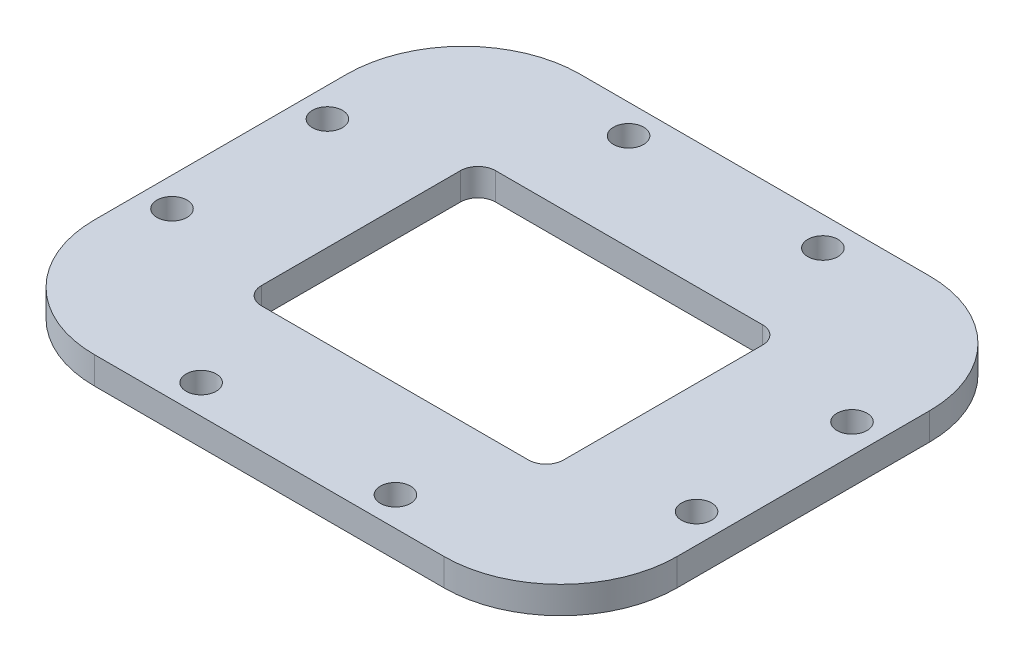
ISO-10303-21;
HEADER;
FILE_DESCRIPTION(('STEP AP214'),'2;1');
FILE_NAME('part.step','',(''),(''),'','','');
FILE_SCHEMA(('AUTOMOTIVE_DESIGN { 1 0 10303 214 1 1 1 1 }'));
ENDSEC;
DATA;
#1=APPLICATION_CONTEXT('core data for automotive mechanical design processes');
#2=APPLICATION_PROTOCOL_DEFINITION('international standard','automotive_design',2000,#1);
#3=PRODUCT_CONTEXT('',#1,'mechanical');
#4=PRODUCT('Part','Part','',(#3));
#5=PRODUCT_RELATED_PRODUCT_CATEGORY('part','',(#4));
#6=PRODUCT_DEFINITION_FORMATION('','',#4);
#7=PRODUCT_DEFINITION_CONTEXT('part definition',#1,'design');
#8=PRODUCT_DEFINITION('design','',#6,#7);
#9=PRODUCT_DEFINITION_SHAPE('','',#8);
#10=(LENGTH_UNIT() NAMED_UNIT(*) SI_UNIT(.MILLI.,.METRE.));
#11=(NAMED_UNIT(*) PLANE_ANGLE_UNIT() SI_UNIT($,.RADIAN.));
#12=(NAMED_UNIT(*) SI_UNIT($,.STERADIAN.) SOLID_ANGLE_UNIT());
#13=UNCERTAINTY_MEASURE_WITH_UNIT(LENGTH_MEASURE(1.E-05),#10,'distance_accuracy_value','');
#14=(GEOMETRIC_REPRESENTATION_CONTEXT(3) GLOBAL_UNCERTAINTY_ASSIGNED_CONTEXT((#13)) GLOBAL_UNIT_ASSIGNED_CONTEXT((#10,
#11,#12)) REPRESENTATION_CONTEXT('',''));
#15=CARTESIAN_POINT('',(0.,0.,0.));
#16=DIRECTION('',(0.,0.,1.));
#17=DIRECTION('',(1.,0.,0.));
#18=AXIS2_PLACEMENT_3D('',#15,#16,#17);
#19=CARTESIAN_POINT('',(0.,2.8,0.));
#20=DIRECTION('',(0.,1.,0.));
#21=DIRECTION('',(0.,0.,1.));
#22=AXIS2_PLACEMENT_3D('',#19,#20,#21);
#23=PLANE('',#22);
#24=CARTESIAN_POINT('',(13.75,2.8,10.25));
#25=DIRECTION('',(0.,1.,0.));
#26=DIRECTION('',(0.,0.,1.));
#27=AXIS2_PLACEMENT_3D('',#24,#25,#26);
#28=CIRCLE('',#27,1.8);
#29=CARTESIAN_POINT('',(13.75,2.8,12.05));
#30=VERTEX_POINT('',#29);
#31=CARTESIAN_POINT('',(15.55,2.8,10.25));
#32=VERTEX_POINT('',#31);
#33=EDGE_CURVE('E211',#30,#32,#28,.T.);
#34=ORIENTED_EDGE('',*,*,#33,.F.);
#35=DIRECTION('',(1.,0.,0.));
#36=VECTOR('',#35,1.);
#37=CARTESIAN_POINT('',(0.,2.8,12.05));
#38=LINE('',#37,#36);
#39=CARTESIAN_POINT('',(-13.75,2.8,12.05));
#40=VERTEX_POINT('',#39);
#41=EDGE_CURVE('E188',#40,#30,#38,.T.);
#42=ORIENTED_EDGE('',*,*,#41,.F.);
#43=CARTESIAN_POINT('',(-13.75,2.8,10.25));
#44=DIRECTION('',(0.,1.,0.));
#45=DIRECTION('',(0.,0.,1.));
#46=AXIS2_PLACEMENT_3D('',#43,#44,#45);
#47=CIRCLE('',#46,1.8);
#48=CARTESIAN_POINT('',(-15.55,2.8,10.25));
#49=VERTEX_POINT('',#48);
#50=EDGE_CURVE('E155',#49,#40,#47,.T.);
#51=ORIENTED_EDGE('',*,*,#50,.F.);
#52=DIRECTION('',(0.,0.,1.));
#53=VECTOR('',#52,1.);
#54=CARTESIAN_POINT('',(-15.55,2.8,0.));
#55=LINE('',#54,#53);
#56=CARTESIAN_POINT('',(-15.55,2.8,-10.25));
#57=VERTEX_POINT('',#56);
#58=EDGE_CURVE('E201',#57,#49,#55,.T.);
#59=ORIENTED_EDGE('',*,*,#58,.F.);
#60=CARTESIAN_POINT('',(-13.75,2.8,-10.25));
#61=DIRECTION('',(0.,1.,0.));
#62=DIRECTION('',(0.,0.,1.));
#63=AXIS2_PLACEMENT_3D('',#60,#61,#62);
#64=CIRCLE('',#63,1.8);
#65=CARTESIAN_POINT('',(-13.75,2.8,-12.05));
#66=VERTEX_POINT('',#65);
#67=EDGE_CURVE('E203',#66,#57,#64,.T.);
#68=ORIENTED_EDGE('',*,*,#67,.F.);
#69=DIRECTION('',(-1.,0.,0.));
#70=VECTOR('',#69,1.);
#71=CARTESIAN_POINT('',(0.,2.8,-12.05));
#72=LINE('',#71,#70);
#73=CARTESIAN_POINT('',(13.75,2.8,-12.05));
#74=VERTEX_POINT('',#73);
#75=EDGE_CURVE('E205',#74,#66,#72,.T.);
#76=ORIENTED_EDGE('',*,*,#75,.F.);
#77=CARTESIAN_POINT('',(13.75,2.8,-10.25));
#78=DIRECTION('',(0.,1.,0.));
#79=DIRECTION('',(0.,0.,1.));
#80=AXIS2_PLACEMENT_3D('',#77,#78,#79);
#81=CIRCLE('',#80,1.8);
#82=CARTESIAN_POINT('',(15.55,2.8,-10.25));
#83=VERTEX_POINT('',#82);
#84=EDGE_CURVE('E207',#83,#74,#81,.T.);
#85=ORIENTED_EDGE('',*,*,#84,.F.);
#86=DIRECTION('',(0.,0.,-1.));
#87=VECTOR('',#86,1.);
#88=CARTESIAN_POINT('',(15.55,2.8,0.));
#89=LINE('',#88,#87);
#90=EDGE_CURVE('E209',#32,#83,#89,.T.);
#91=ORIENTED_EDGE('',*,*,#90,.F.);
#92=EDGE_LOOP('',(#34,#42,#51,#59,#68,#76,#85,#91));
#93=FACE_BOUND('',#92,.T.);
#94=CARTESIAN_POINT('',(10.,2.8,22.));
#95=DIRECTION('',(0.,1.,0.));
#96=DIRECTION('',(0.,0.,1.));
#97=AXIS2_PLACEMENT_3D('',#94,#95,#96);
#98=CIRCLE('',#97,1.55);
#99=CARTESIAN_POINT('',(10.,2.8,23.55));
#100=VERTEX_POINT('',#99);
#101=EDGE_CURVE('E258',#100,#100,#98,.T.);
#102=ORIENTED_EDGE('',*,*,#101,.F.);
#103=EDGE_LOOP('',(#102));
#104=FACE_BOUND('',#103,.T.);
#105=CARTESIAN_POINT('',(-10.,2.8,22.));
#106=DIRECTION('',(0.,1.,0.));
#107=DIRECTION('',(0.,0.,1.));
#108=AXIS2_PLACEMENT_3D('',#105,#106,#107);
#109=CIRCLE('',#108,1.55);
#110=CARTESIAN_POINT('',(-10.,2.8,23.55));
#111=VERTEX_POINT('',#110);
#112=EDGE_CURVE('E255',#111,#111,#109,.T.);
#113=ORIENTED_EDGE('',*,*,#112,.F.);
#114=EDGE_LOOP('',(#113));
#115=FACE_BOUND('',#114,.T.);
#116=CARTESIAN_POINT('',(-27.,2.8,8.));
#117=DIRECTION('',(0.,1.,0.));
#118=DIRECTION('',(0.,0.,1.));
#119=AXIS2_PLACEMENT_3D('',#116,#117,#118);
#120=CIRCLE('',#119,1.55);
#121=CARTESIAN_POINT('',(-27.,2.8,9.55));
#122=VERTEX_POINT('',#121);
#123=EDGE_CURVE('E252',#122,#122,#120,.T.);
#124=ORIENTED_EDGE('',*,*,#123,.F.);
#125=EDGE_LOOP('',(#124));
#126=FACE_BOUND('',#125,.T.);
#127=CARTESIAN_POINT('',(-27.,2.8,-8.));
#128=DIRECTION('',(0.,1.,0.));
#129=DIRECTION('',(0.,0.,1.));
#130=AXIS2_PLACEMENT_3D('',#127,#128,#129);
#131=CIRCLE('',#130,1.55);
#132=CARTESIAN_POINT('',(-27.,2.8,-6.45));
#133=VERTEX_POINT('',#132);
#134=EDGE_CURVE('E249',#133,#133,#131,.T.);
#135=ORIENTED_EDGE('',*,*,#134,.F.);
#136=EDGE_LOOP('',(#135));
#137=FACE_BOUND('',#136,.T.);
#138=CARTESIAN_POINT('',(-10.,2.8,-22.));
#139=DIRECTION('',(0.,1.,0.));
#140=DIRECTION('',(0.,0.,1.));
#141=AXIS2_PLACEMENT_3D('',#138,#139,#140);
#142=CIRCLE('',#141,1.55);
#143=CARTESIAN_POINT('',(-10.,2.8,-20.45));
#144=VERTEX_POINT('',#143);
#145=EDGE_CURVE('E246',#144,#144,#142,.T.);
#146=ORIENTED_EDGE('',*,*,#145,.F.);
#147=EDGE_LOOP('',(#146));
#148=FACE_BOUND('',#147,.T.);
#149=CARTESIAN_POINT('',(10.,2.8,-22.));
#150=DIRECTION('',(0.,1.,0.));
#151=DIRECTION('',(0.,0.,1.));
#152=AXIS2_PLACEMENT_3D('',#149,#150,#151);
#153=CIRCLE('',#152,1.55);
#154=CARTESIAN_POINT('',(10.,2.8,-20.45));
#155=VERTEX_POINT('',#154);
#156=EDGE_CURVE('E243',#155,#155,#153,.T.);
#157=ORIENTED_EDGE('',*,*,#156,.F.);
#158=EDGE_LOOP('',(#157));
#159=FACE_BOUND('',#158,.T.);
#160=CARTESIAN_POINT('',(27.,2.8,-8.));
#161=DIRECTION('',(0.,1.,0.));
#162=DIRECTION('',(0.,0.,1.));
#163=AXIS2_PLACEMENT_3D('',#160,#161,#162);
#164=CIRCLE('',#163,1.55);
#165=CARTESIAN_POINT('',(27.,2.8,-6.45));
#166=VERTEX_POINT('',#165);
#167=EDGE_CURVE('E240',#166,#166,#164,.T.);
#168=ORIENTED_EDGE('',*,*,#167,.F.);
#169=EDGE_LOOP('',(#168));
#170=FACE_BOUND('',#169,.T.);
#171=CARTESIAN_POINT('',(27.,2.8,8.));
#172=DIRECTION('',(0.,1.,0.));
#173=DIRECTION('',(0.,0.,1.));
#174=AXIS2_PLACEMENT_3D('',#171,#172,#173);
#175=CIRCLE('',#174,1.55);
#176=CARTESIAN_POINT('',(27.,2.8,9.55));
#177=VERTEX_POINT('',#176);
#178=EDGE_CURVE('E237',#177,#177,#175,.T.);
#179=ORIENTED_EDGE('',*,*,#178,.F.);
#180=EDGE_LOOP('',(#179));
#181=FACE_BOUND('',#180,.T.);
#182=DIRECTION('',(1.,0.,0.));
#183=VECTOR('',#182,1.);
#184=CARTESIAN_POINT('',(-30.,2.8,25.));
#185=LINE('',#184,#183);
#186=CARTESIAN_POINT('',(-18.,2.8,25.));
#187=VERTEX_POINT('',#186);
#188=CARTESIAN_POINT('',(18.,2.8,25.));
#189=VERTEX_POINT('',#188);
#190=EDGE_CURVE('E272',#187,#189,#185,.T.);
#191=ORIENTED_EDGE('',*,*,#190,.T.);
#192=CARTESIAN_POINT('',(18.,2.8,13.));
#193=DIRECTION('',(0.,1.,0.));
#194=DIRECTION('',(0.,0.,1.));
#195=AXIS2_PLACEMENT_3D('',#192,#193,#194);
#196=CIRCLE('',#195,12.);
#197=CARTESIAN_POINT('',(30.,2.8,13.));
#198=VERTEX_POINT('',#197);
#199=EDGE_CURVE('E309',#189,#198,#196,.T.);
#200=ORIENTED_EDGE('',*,*,#199,.T.);
#201=DIRECTION('',(0.,0.,-1.));
#202=VECTOR('',#201,1.);
#203=CARTESIAN_POINT('',(30.,2.8,-25.));
#204=LINE('',#203,#202);
#205=CARTESIAN_POINT('',(30.,2.8,-13.));
#206=VERTEX_POINT('',#205);
#207=EDGE_CURVE('E262',#198,#206,#204,.T.);
#208=ORIENTED_EDGE('',*,*,#207,.T.);
#209=CARTESIAN_POINT('',(18.,2.8,-13.));
#210=DIRECTION('',(0.,1.,0.));
#211=DIRECTION('',(0.,0.,1.));
#212=AXIS2_PLACEMENT_3D('',#209,#210,#211);
#213=CIRCLE('',#212,12.);
#214=CARTESIAN_POINT('',(18.,2.8,-25.));
#215=VERTEX_POINT('',#214);
#216=EDGE_CURVE('E305',#206,#215,#213,.T.);
#217=ORIENTED_EDGE('',*,*,#216,.T.);
#218=DIRECTION('',(-1.,0.,0.));
#219=VECTOR('',#218,1.);
#220=CARTESIAN_POINT('',(-30.,2.8,-25.));
#221=LINE('',#220,#219);
#222=CARTESIAN_POINT('',(-18.,2.8,-25.));
#223=VERTEX_POINT('',#222);
#224=EDGE_CURVE('E265',#215,#223,#221,.T.);
#225=ORIENTED_EDGE('',*,*,#224,.T.);
#226=CARTESIAN_POINT('',(-18.,2.8,-13.));
#227=DIRECTION('',(0.,1.,0.));
#228=DIRECTION('',(0.,0.,1.));
#229=AXIS2_PLACEMENT_3D('',#226,#227,#228);
#230=CIRCLE('',#229,12.);
#231=CARTESIAN_POINT('',(-30.,2.8,-13.));
#232=VERTEX_POINT('',#231);
#233=EDGE_CURVE('E307',#223,#232,#230,.T.);
#234=ORIENTED_EDGE('',*,*,#233,.T.);
#235=DIRECTION('',(0.,0.,1.));
#236=VECTOR('',#235,1.);
#237=CARTESIAN_POINT('',(-30.,2.8,-25.));
#238=LINE('',#237,#236);
#239=CARTESIAN_POINT('',(-30.,2.8,13.));
#240=VERTEX_POINT('',#239);
#241=EDGE_CURVE('E269',#232,#240,#238,.T.);
#242=ORIENTED_EDGE('',*,*,#241,.T.);
#243=CARTESIAN_POINT('',(-18.,2.8,13.));
#244=DIRECTION('',(0.,1.,0.));
#245=DIRECTION('',(0.,0.,1.));
#246=AXIS2_PLACEMENT_3D('',#243,#244,#245);
#247=CIRCLE('',#246,12.);
#248=EDGE_CURVE('E303',#240,#187,#247,.T.);
#249=ORIENTED_EDGE('',*,*,#248,.T.);
#250=EDGE_LOOP('',(#191,#200,#208,#217,#225,#234,#242,#249));
#251=FACE_BOUND('',#250,.T.);
#252=ADVANCED_FACE('F37',(#93,#104,#115,#126,#137,#148,#159,#170,#181,#251),#23,.T.);
#253=CARTESIAN_POINT('',(0.,0.,0.));
#254=DIRECTION('',(0.,1.,0.));
#255=DIRECTION('',(0.,0.,1.));
#256=AXIS2_PLACEMENT_3D('',#253,#254,#255);
#257=PLANE('',#256);
#258=DIRECTION('',(-1.,0.,0.));
#259=VECTOR('',#258,1.);
#260=CARTESIAN_POINT('',(-13.75,0.,12.05));
#261=LINE('',#260,#259);
#262=CARTESIAN_POINT('',(13.75,0.,12.05));
#263=VERTEX_POINT('',#262);
#264=CARTESIAN_POINT('',(-13.75,0.,12.05));
#265=VERTEX_POINT('',#264);
#266=EDGE_CURVE('E161',#263,#265,#261,.T.);
#267=ORIENTED_EDGE('',*,*,#266,.F.);
#268=CARTESIAN_POINT('',(13.75,0.,10.25));
#269=DIRECTION('',(0.,-1.,0.));
#270=DIRECTION('',(0.,0.,-1.));
#271=AXIS2_PLACEMENT_3D('',#268,#269,#270);
#272=CIRCLE('',#271,1.8);
#273=CARTESIAN_POINT('',(15.55,0.,10.25));
#274=VERTEX_POINT('',#273);
#275=EDGE_CURVE('E60',#274,#263,#272,.T.);
#276=ORIENTED_EDGE('',*,*,#275,.F.);
#277=DIRECTION('',(0.,0.,1.));
#278=VECTOR('',#277,1.);
#279=CARTESIAN_POINT('',(15.55,0.,10.25));
#280=LINE('',#279,#278);
#281=CARTESIAN_POINT('',(15.55,0.,-10.25));
#282=VERTEX_POINT('',#281);
#283=EDGE_CURVE('E183',#282,#274,#280,.T.);
#284=ORIENTED_EDGE('',*,*,#283,.F.);
#285=CARTESIAN_POINT('',(13.75,0.,-10.25));
#286=DIRECTION('',(0.,-1.,0.));
#287=DIRECTION('',(0.,0.,-1.));
#288=AXIS2_PLACEMENT_3D('',#285,#286,#287);
#289=CIRCLE('',#288,1.8);
#290=CARTESIAN_POINT('',(13.75,0.,-12.05));
#291=VERTEX_POINT('',#290);
#292=EDGE_CURVE('E180',#291,#282,#289,.T.);
#293=ORIENTED_EDGE('',*,*,#292,.F.);
#294=DIRECTION('',(1.,0.,0.));
#295=VECTOR('',#294,1.);
#296=CARTESIAN_POINT('',(13.75,0.,-12.05));
#297=LINE('',#296,#295);
#298=CARTESIAN_POINT('',(-13.75,0.,-12.05));
#299=VERTEX_POINT('',#298);
#300=EDGE_CURVE('E177',#299,#291,#297,.T.);
#301=ORIENTED_EDGE('',*,*,#300,.F.);
#302=CARTESIAN_POINT('',(-13.75,0.,-10.25));
#303=DIRECTION('',(0.,-1.,0.));
#304=DIRECTION('',(0.,0.,-1.));
#305=AXIS2_PLACEMENT_3D('',#302,#303,#304);
#306=CIRCLE('',#305,1.8);
#307=CARTESIAN_POINT('',(-15.55,0.,-10.25));
#308=VERTEX_POINT('',#307);
#309=EDGE_CURVE('E171',#308,#299,#306,.T.);
#310=ORIENTED_EDGE('',*,*,#309,.F.);
#311=DIRECTION('',(0.,0.,-1.));
#312=VECTOR('',#311,1.);
#313=CARTESIAN_POINT('',(-15.55,0.,-10.25));
#314=LINE('',#313,#312);
#315=CARTESIAN_POINT('',(-15.55,0.,10.25));
#316=VERTEX_POINT('',#315);
#317=EDGE_CURVE('E169',#316,#308,#314,.T.);
#318=ORIENTED_EDGE('',*,*,#317,.F.);
#319=CARTESIAN_POINT('',(-13.75,0.,10.25));
#320=DIRECTION('',(0.,-1.,0.));
#321=DIRECTION('',(0.,0.,-1.));
#322=AXIS2_PLACEMENT_3D('',#319,#320,#321);
#323=CIRCLE('',#322,1.8);
#324=EDGE_CURVE('E152',#265,#316,#323,.T.);
#325=ORIENTED_EDGE('',*,*,#324,.F.);
#326=EDGE_LOOP('',(#267,#276,#284,#293,#301,#310,#318,#325));
#327=FACE_BOUND('',#326,.T.);
#328=CARTESIAN_POINT('',(10.,0.,22.));
#329=DIRECTION('',(0.,-1.,0.));
#330=DIRECTION('',(0.,0.,-1.));
#331=AXIS2_PLACEMENT_3D('',#328,#329,#330);
#332=CIRCLE('',#331,1.55);
#333=CARTESIAN_POINT('',(10.,0.,20.45));
#334=VERTEX_POINT('',#333);
#335=EDGE_CURVE('E223',#334,#334,#332,.T.);
#336=ORIENTED_EDGE('',*,*,#335,.F.);
#337=EDGE_LOOP('',(#336));
#338=FACE_BOUND('',#337,.T.);
#339=CARTESIAN_POINT('',(-10.,0.,22.));
#340=DIRECTION('',(0.,-1.,0.));
#341=DIRECTION('',(0.,0.,1.));
#342=AXIS2_PLACEMENT_3D('',#339,#340,#341);
#343=CIRCLE('',#342,1.55);
#344=CARTESIAN_POINT('',(-10.,0.,23.55));
#345=VERTEX_POINT('',#344);
#346=EDGE_CURVE('E227',#345,#345,#343,.T.);
#347=ORIENTED_EDGE('',*,*,#346,.F.);
#348=EDGE_LOOP('',(#347));
#349=FACE_BOUND('',#348,.T.);
#350=CARTESIAN_POINT('',(-27.,0.,8.));
#351=DIRECTION('',(0.,-1.,0.));
#352=DIRECTION('',(0.,0.,1.));
#353=AXIS2_PLACEMENT_3D('',#350,#351,#352);
#354=CIRCLE('',#353,1.55);
#355=CARTESIAN_POINT('',(-27.,0.,9.55));
#356=VERTEX_POINT('',#355);
#357=EDGE_CURVE('E230',#356,#356,#354,.T.);
#358=ORIENTED_EDGE('',*,*,#357,.F.);
#359=EDGE_LOOP('',(#358));
#360=FACE_BOUND('',#359,.T.);
#361=CARTESIAN_POINT('',(-27.,0.,-8.));
#362=DIRECTION('',(0.,-1.,0.));
#363=DIRECTION('',(0.,0.,-1.));
#364=AXIS2_PLACEMENT_3D('',#361,#362,#363);
#365=CIRCLE('',#364,1.55);
#366=CARTESIAN_POINT('',(-27.,0.,-9.55));
#367=VERTEX_POINT('',#366);
#368=EDGE_CURVE('E217',#367,#367,#365,.T.);
#369=ORIENTED_EDGE('',*,*,#368,.F.);
#370=EDGE_LOOP('',(#369));
#371=FACE_BOUND('',#370,.T.);
#372=CARTESIAN_POINT('',(-10.,0.,-22.));
#373=DIRECTION('',(0.,-1.,0.));
#374=DIRECTION('',(0.,0.,-1.));
#375=AXIS2_PLACEMENT_3D('',#372,#373,#374);
#376=CIRCLE('',#375,1.55);
#377=CARTESIAN_POINT('',(-10.,0.,-23.55));
#378=VERTEX_POINT('',#377);
#379=EDGE_CURVE('E214',#378,#378,#376,.T.);
#380=ORIENTED_EDGE('',*,*,#379,.F.);
#381=EDGE_LOOP('',(#380));
#382=FACE_BOUND('',#381,.T.);
#383=CARTESIAN_POINT('',(10.,0.,-22.));
#384=DIRECTION('',(0.,-1.,0.));
#385=DIRECTION('',(0.,0.,1.));
#386=AXIS2_PLACEMENT_3D('',#383,#384,#385);
#387=CIRCLE('',#386,1.55);
#388=CARTESIAN_POINT('',(10.,0.,-20.45));
#389=VERTEX_POINT('',#388);
#390=EDGE_CURVE('E218',#389,#389,#387,.T.);
#391=ORIENTED_EDGE('',*,*,#390,.F.);
#392=EDGE_LOOP('',(#391));
#393=FACE_BOUND('',#392,.T.);
#394=CARTESIAN_POINT('',(27.,0.,-8.));
#395=DIRECTION('',(0.,-1.,0.));
#396=DIRECTION('',(0.,0.,1.));
#397=AXIS2_PLACEMENT_3D('',#394,#395,#396);
#398=CIRCLE('',#397,1.55);
#399=CARTESIAN_POINT('',(27.,0.,-6.45));
#400=VERTEX_POINT('',#399);
#401=EDGE_CURVE('E213',#400,#400,#398,.T.);
#402=ORIENTED_EDGE('',*,*,#401,.F.);
#403=EDGE_LOOP('',(#402));
#404=FACE_BOUND('',#403,.T.);
#405=CARTESIAN_POINT('',(27.,0.,8.));
#406=DIRECTION('',(0.,-1.,0.));
#407=DIRECTION('',(0.,0.,-1.));
#408=AXIS2_PLACEMENT_3D('',#405,#406,#407);
#409=CIRCLE('',#408,1.55);
#410=CARTESIAN_POINT('',(27.,0.,6.45));
#411=VERTEX_POINT('',#410);
#412=EDGE_CURVE('E226',#411,#411,#409,.T.);
#413=ORIENTED_EDGE('',*,*,#412,.F.);
#414=EDGE_LOOP('',(#413));
#415=FACE_BOUND('',#414,.T.);
#416=DIRECTION('',(0.,0.,-1.));
#417=VECTOR('',#416,1.);
#418=CARTESIAN_POINT('',(30.,0.,-25.));
#419=LINE('',#418,#417);
#420=CARTESIAN_POINT('',(30.,0.,13.));
#421=VERTEX_POINT('',#420);
#422=CARTESIAN_POINT('',(30.,0.,-13.));
#423=VERTEX_POINT('',#422);
#424=EDGE_CURVE('E261',#421,#423,#419,.T.);
#425=ORIENTED_EDGE('',*,*,#424,.F.);
#426=CARTESIAN_POINT('',(18.,0.,13.));
#427=DIRECTION('',(0.,1.,0.));
#428=DIRECTION('',(0.,0.,1.));
#429=AXIS2_PLACEMENT_3D('',#426,#427,#428);
#430=CIRCLE('',#429,12.);
#431=CARTESIAN_POINT('',(18.,0.,25.));
#432=VERTEX_POINT('',#431);
#433=EDGE_CURVE('E296',#421,#432,#430,.F.);
#434=ORIENTED_EDGE('',*,*,#433,.T.);
#435=DIRECTION('',(1.,0.,0.));
#436=VECTOR('',#435,1.);
#437=CARTESIAN_POINT('',(-30.,0.,25.));
#438=LINE('',#437,#436);
#439=CARTESIAN_POINT('',(-18.,0.,25.));
#440=VERTEX_POINT('',#439);
#441=EDGE_CURVE('E266',#440,#432,#438,.T.);
#442=ORIENTED_EDGE('',*,*,#441,.F.);
#443=CARTESIAN_POINT('',(-18.,0.,13.));
#444=DIRECTION('',(0.,1.,0.));
#445=DIRECTION('',(0.,0.,1.));
#446=AXIS2_PLACEMENT_3D('',#443,#444,#445);
#447=CIRCLE('',#446,12.);
#448=CARTESIAN_POINT('',(-30.,0.,13.));
#449=VERTEX_POINT('',#448);
#450=EDGE_CURVE('E290',#440,#449,#447,.F.);
#451=ORIENTED_EDGE('',*,*,#450,.T.);
#452=DIRECTION('',(0.,0.,1.));
#453=VECTOR('',#452,1.);
#454=CARTESIAN_POINT('',(-30.,0.,-25.));
#455=LINE('',#454,#453);
#456=CARTESIAN_POINT('',(-30.,0.,-13.));
#457=VERTEX_POINT('',#456);
#458=EDGE_CURVE('E281',#457,#449,#455,.T.);
#459=ORIENTED_EDGE('',*,*,#458,.F.);
#460=CARTESIAN_POINT('',(-18.,0.,-13.));
#461=DIRECTION('',(0.,1.,0.));
#462=DIRECTION('',(0.,0.,1.));
#463=AXIS2_PLACEMENT_3D('',#460,#461,#462);
#464=CIRCLE('',#463,12.);
#465=CARTESIAN_POINT('',(-18.,0.,-25.));
#466=VERTEX_POINT('',#465);
#467=EDGE_CURVE('E294',#457,#466,#464,.F.);
#468=ORIENTED_EDGE('',*,*,#467,.T.);
#469=DIRECTION('',(-1.,0.,0.));
#470=VECTOR('',#469,1.);
#471=CARTESIAN_POINT('',(-30.,0.,-25.));
#472=LINE('',#471,#470);
#473=CARTESIAN_POINT('',(18.,0.,-25.));
#474=VERTEX_POINT('',#473);
#475=EDGE_CURVE('E278',#474,#466,#472,.T.);
#476=ORIENTED_EDGE('',*,*,#475,.F.);
#477=CARTESIAN_POINT('',(18.,0.,-13.));
#478=DIRECTION('',(0.,1.,0.));
#479=DIRECTION('',(0.,0.,1.));
#480=AXIS2_PLACEMENT_3D('',#477,#478,#479);
#481=CIRCLE('',#480,12.);
#482=EDGE_CURVE('E292',#474,#423,#481,.F.);
#483=ORIENTED_EDGE('',*,*,#482,.T.);
#484=EDGE_LOOP('',(#425,#434,#442,#451,#459,#468,#476,#483));
#485=FACE_BOUND('',#484,.T.);
#486=ADVANCED_FACE('F165',(#327,#338,#349,#360,#371,#382,#393,#404,#415,#485),#257,.F.);
#487=CARTESIAN_POINT('',(30.,2.8,-25.));
#488=DIRECTION('',(-1.,0.,0.));
#489=DIRECTION('',(0.,0.,1.));
#490=AXIS2_PLACEMENT_3D('',#487,#488,#489);
#491=PLANE('',#490);
#492=ORIENTED_EDGE('',*,*,#207,.F.);
#493=DIRECTION('',(0.,-1.,0.));
#494=VECTOR('',#493,1.);
#495=CARTESIAN_POINT('',(30.,2.8,13.));
#496=LINE('',#495,#494);
#497=EDGE_CURVE('E287',#198,#421,#496,.T.);
#498=ORIENTED_EDGE('',*,*,#497,.T.);
#499=ORIENTED_EDGE('',*,*,#424,.T.);
#500=DIRECTION('',(0.,-1.,0.));
#501=VECTOR('',#500,1.);
#502=CARTESIAN_POINT('',(30.,2.8,-13.));
#503=LINE('',#502,#501);
#504=EDGE_CURVE('E275',#423,#206,#503,.F.);
#505=ORIENTED_EDGE('',*,*,#504,.T.);
#506=EDGE_LOOP('',(#492,#498,#499,#505));
#507=FACE_BOUND('',#506,.T.);
#508=ADVANCED_FACE('F350',(#507),#491,.F.);
#509=CARTESIAN_POINT('',(-30.,2.8,-25.));
#510=DIRECTION('',(0.,0.,1.));
#511=DIRECTION('',(1.,0.,0.));
#512=AXIS2_PLACEMENT_3D('',#509,#510,#511);
#513=PLANE('',#512);
#514=ORIENTED_EDGE('',*,*,#475,.T.);
#515=DIRECTION('',(0.,-1.,0.));
#516=VECTOR('',#515,1.);
#517=CARTESIAN_POINT('',(-18.,2.8,-25.));
#518=LINE('',#517,#516);
#519=EDGE_CURVE('E11',#466,#223,#518,.F.);
#520=ORIENTED_EDGE('',*,*,#519,.T.);
#521=ORIENTED_EDGE('',*,*,#224,.F.);
#522=DIRECTION('',(0.,-1.,0.));
#523=VECTOR('',#522,1.);
#524=CARTESIAN_POINT('',(18.,2.8,-25.));
#525=LINE('',#524,#523);
#526=EDGE_CURVE('E45',#215,#474,#525,.T.);
#527=ORIENTED_EDGE('',*,*,#526,.T.);
#528=EDGE_LOOP('',(#514,#520,#521,#527));
#529=FACE_BOUND('',#528,.T.);
#530=ADVANCED_FACE('F320',(#529),#513,.F.);
#531=CARTESIAN_POINT('',(-30.,2.8,-25.));
#532=DIRECTION('',(1.,0.,0.));
#533=DIRECTION('',(0.,0.,-1.));
#534=AXIS2_PLACEMENT_3D('',#531,#532,#533);
#535=PLANE('',#534);
#536=ORIENTED_EDGE('',*,*,#241,.F.);
#537=DIRECTION('',(0.,-1.,0.));
#538=VECTOR('',#537,1.);
#539=CARTESIAN_POINT('',(-30.,2.8,-13.));
#540=LINE('',#539,#538);
#541=EDGE_CURVE('E313',#232,#457,#540,.T.);
#542=ORIENTED_EDGE('',*,*,#541,.T.);
#543=ORIENTED_EDGE('',*,*,#458,.T.);
#544=DIRECTION('',(0.,-1.,0.));
#545=VECTOR('',#544,1.);
#546=CARTESIAN_POINT('',(-30.,2.8,13.));
#547=LINE('',#546,#545);
#548=EDGE_CURVE('E311',#449,#240,#547,.F.);
#549=ORIENTED_EDGE('',*,*,#548,.T.);
#550=EDGE_LOOP('',(#536,#542,#543,#549));
#551=FACE_BOUND('',#550,.T.);
#552=ADVANCED_FACE('F333',(#551),#535,.F.);
#553=CARTESIAN_POINT('',(-30.,2.8,25.));
#554=DIRECTION('',(0.,0.,-1.));
#555=DIRECTION('',(-1.,0.,0.));
#556=AXIS2_PLACEMENT_3D('',#553,#554,#555);
#557=PLANE('',#556);
#558=ORIENTED_EDGE('',*,*,#441,.T.);
#559=DIRECTION('',(0.,-1.,0.));
#560=VECTOR('',#559,1.);
#561=CARTESIAN_POINT('',(18.,2.8,25.));
#562=LINE('',#561,#560);
#563=EDGE_CURVE('E301',#432,#189,#562,.F.);
#564=ORIENTED_EDGE('',*,*,#563,.T.);
#565=ORIENTED_EDGE('',*,*,#190,.F.);
#566=DIRECTION('',(0.,-1.,0.));
#567=VECTOR('',#566,1.);
#568=CARTESIAN_POINT('',(-18.,2.8,25.));
#569=LINE('',#568,#567);
#570=EDGE_CURVE('E298',#187,#440,#569,.T.);
#571=ORIENTED_EDGE('',*,*,#570,.T.);
#572=EDGE_LOOP('',(#558,#564,#565,#571));
#573=FACE_BOUND('',#572,.T.);
#574=ADVANCED_FACE('F342',(#573),#557,.F.);
#575=CARTESIAN_POINT('',(27.,10.,8.));
#576=DIRECTION('',(0.,-1.,0.));
#577=DIRECTION('',(0.,0.,-1.));
#578=AXIS2_PLACEMENT_3D('',#575,#576,#577);
#579=CYLINDRICAL_SURFACE('',#578,1.55);
#580=ORIENTED_EDGE('',*,*,#178,.T.);
#581=EDGE_LOOP('',(#580));
#582=FACE_BOUND('',#581,.T.);
#583=ORIENTED_EDGE('',*,*,#412,.T.);
#584=EDGE_LOOP('',(#583));
#585=FACE_BOUND('',#584,.T.);
#586=ADVANCED_FACE('F370',(#582,#585),#579,.F.);
#587=CARTESIAN_POINT('',(27.,10.,-8.));
#588=DIRECTION('',(0.,-1.,0.));
#589=DIRECTION('',(0.,0.,-1.));
#590=AXIS2_PLACEMENT_3D('',#587,#588,#589);
#591=CYLINDRICAL_SURFACE('',#590,1.55);
#592=ORIENTED_EDGE('',*,*,#167,.T.);
#593=EDGE_LOOP('',(#592));
#594=FACE_BOUND('',#593,.T.);
#595=ORIENTED_EDGE('',*,*,#401,.T.);
#596=EDGE_LOOP('',(#595));
#597=FACE_BOUND('',#596,.T.);
#598=ADVANCED_FACE('F397',(#594,#597),#591,.F.);
#599=CARTESIAN_POINT('',(10.,10.,-22.));
#600=DIRECTION('',(0.,-1.,0.));
#601=DIRECTION('',(0.,0.,-1.));
#602=AXIS2_PLACEMENT_3D('',#599,#600,#601);
#603=CYLINDRICAL_SURFACE('',#602,1.55);
#604=ORIENTED_EDGE('',*,*,#156,.T.);
#605=EDGE_LOOP('',(#604));
#606=FACE_BOUND('',#605,.T.);
#607=ORIENTED_EDGE('',*,*,#390,.T.);
#608=EDGE_LOOP('',(#607));
#609=FACE_BOUND('',#608,.T.);
#610=ADVANCED_FACE('F409',(#606,#609),#603,.F.);
#611=CARTESIAN_POINT('',(-10.,10.,-22.));
#612=DIRECTION('',(0.,-1.,0.));
#613=DIRECTION('',(0.,0.,-1.));
#614=AXIS2_PLACEMENT_3D('',#611,#612,#613);
#615=CYLINDRICAL_SURFACE('',#614,1.55);
#616=ORIENTED_EDGE('',*,*,#145,.T.);
#617=EDGE_LOOP('',(#616));
#618=FACE_BOUND('',#617,.T.);
#619=ORIENTED_EDGE('',*,*,#379,.T.);
#620=EDGE_LOOP('',(#619));
#621=FACE_BOUND('',#620,.T.);
#622=ADVANCED_FACE('F404',(#618,#621),#615,.F.);
#623=CARTESIAN_POINT('',(-27.,10.,-8.));
#624=DIRECTION('',(0.,-1.,0.));
#625=DIRECTION('',(0.,0.,-1.));
#626=AXIS2_PLACEMENT_3D('',#623,#624,#625);
#627=CYLINDRICAL_SURFACE('',#626,1.55);
#628=ORIENTED_EDGE('',*,*,#134,.T.);
#629=EDGE_LOOP('',(#628));
#630=FACE_BOUND('',#629,.T.);
#631=ORIENTED_EDGE('',*,*,#368,.T.);
#632=EDGE_LOOP('',(#631));
#633=FACE_BOUND('',#632,.T.);
#634=ADVANCED_FACE('F401',(#630,#633),#627,.F.);
#635=CARTESIAN_POINT('',(-27.,10.,8.));
#636=DIRECTION('',(0.,-1.,0.));
#637=DIRECTION('',(0.,0.,-1.));
#638=AXIS2_PLACEMENT_3D('',#635,#636,#637);
#639=CYLINDRICAL_SURFACE('',#638,1.55);
#640=ORIENTED_EDGE('',*,*,#123,.T.);
#641=EDGE_LOOP('',(#640));
#642=FACE_BOUND('',#641,.T.);
#643=ORIENTED_EDGE('',*,*,#357,.T.);
#644=EDGE_LOOP('',(#643));
#645=FACE_BOUND('',#644,.T.);
#646=ADVANCED_FACE('F392',(#642,#645),#639,.F.);
#647=CARTESIAN_POINT('',(-10.,10.,22.));
#648=DIRECTION('',(0.,-1.,0.));
#649=DIRECTION('',(0.,0.,-1.));
#650=AXIS2_PLACEMENT_3D('',#647,#648,#649);
#651=CYLINDRICAL_SURFACE('',#650,1.55);
#652=ORIENTED_EDGE('',*,*,#112,.T.);
#653=EDGE_LOOP('',(#652));
#654=FACE_BOUND('',#653,.T.);
#655=ORIENTED_EDGE('',*,*,#346,.T.);
#656=EDGE_LOOP('',(#655));
#657=FACE_BOUND('',#656,.T.);
#658=ADVANCED_FACE('F386',(#654,#657),#651,.F.);
#659=CARTESIAN_POINT('',(10.,10.,22.));
#660=DIRECTION('',(0.,-1.,0.));
#661=DIRECTION('',(0.,0.,-1.));
#662=AXIS2_PLACEMENT_3D('',#659,#660,#661);
#663=CYLINDRICAL_SURFACE('',#662,1.55);
#664=ORIENTED_EDGE('',*,*,#101,.T.);
#665=EDGE_LOOP('',(#664));
#666=FACE_BOUND('',#665,.T.);
#667=ORIENTED_EDGE('',*,*,#335,.T.);
#668=EDGE_LOOP('',(#667));
#669=FACE_BOUND('',#668,.T.);
#670=ADVANCED_FACE('F382',(#666,#669),#663,.F.);
#671=CARTESIAN_POINT('',(18.,2.8,13.));
#672=DIRECTION('',(0.,-1.,0.));
#673=DIRECTION('',(0.,0.,-1.));
#674=AXIS2_PLACEMENT_3D('',#671,#672,#673);
#675=CYLINDRICAL_SURFACE('',#674,12.);
#676=ORIENTED_EDGE('',*,*,#199,.F.);
#677=ORIENTED_EDGE('',*,*,#563,.F.);
#678=ORIENTED_EDGE('',*,*,#433,.F.);
#679=ORIENTED_EDGE('',*,*,#497,.F.);
#680=EDGE_LOOP('',(#676,#677,#678,#679));
#681=FACE_BOUND('',#680,.T.);
#682=ADVANCED_FACE('F347',(#681),#675,.T.);
#683=CARTESIAN_POINT('',(-18.,2.8,-13.));
#684=DIRECTION('',(0.,-1.,0.));
#685=DIRECTION('',(0.,0.,-1.));
#686=AXIS2_PLACEMENT_3D('',#683,#684,#685);
#687=CYLINDRICAL_SURFACE('',#686,12.);
#688=ORIENTED_EDGE('',*,*,#233,.F.);
#689=ORIENTED_EDGE('',*,*,#519,.F.);
#690=ORIENTED_EDGE('',*,*,#467,.F.);
#691=ORIENTED_EDGE('',*,*,#541,.F.);
#692=EDGE_LOOP('',(#688,#689,#690,#691));
#693=FACE_BOUND('',#692,.T.);
#694=ADVANCED_FACE('F330',(#693),#687,.T.);
#695=CARTESIAN_POINT('',(18.,2.8,-13.));
#696=DIRECTION('',(0.,-1.,0.));
#697=DIRECTION('',(0.,0.,-1.));
#698=AXIS2_PLACEMENT_3D('',#695,#696,#697);
#699=CYLINDRICAL_SURFACE('',#698,12.);
#700=ORIENTED_EDGE('',*,*,#216,.F.);
#701=ORIENTED_EDGE('',*,*,#504,.F.);
#702=ORIENTED_EDGE('',*,*,#482,.F.);
#703=ORIENTED_EDGE('',*,*,#526,.F.);
#704=EDGE_LOOP('',(#700,#701,#702,#703));
#705=FACE_BOUND('',#704,.T.);
#706=ADVANCED_FACE('F352',(#705),#699,.T.);
#707=CARTESIAN_POINT('',(-18.,2.8,13.));
#708=DIRECTION('',(0.,-1.,0.));
#709=DIRECTION('',(0.,0.,-1.));
#710=AXIS2_PLACEMENT_3D('',#707,#708,#709);
#711=CYLINDRICAL_SURFACE('',#710,12.);
#712=ORIENTED_EDGE('',*,*,#248,.F.);
#713=ORIENTED_EDGE('',*,*,#548,.F.);
#714=ORIENTED_EDGE('',*,*,#450,.F.);
#715=ORIENTED_EDGE('',*,*,#570,.F.);
#716=EDGE_LOOP('',(#712,#713,#714,#715));
#717=FACE_BOUND('',#716,.T.);
#718=ADVANCED_FACE('F39',(#717),#711,.T.);
#719=CARTESIAN_POINT('',(13.75,10.,10.25));
#720=DIRECTION('',(0.,-1.,0.));
#721=DIRECTION('',(0.,0.,-1.));
#722=AXIS2_PLACEMENT_3D('',#719,#720,#721);
#723=CYLINDRICAL_SURFACE('',#722,1.8);
#724=ORIENTED_EDGE('',*,*,#33,.T.);
#725=DIRECTION('',(0.,-1.,0.));
#726=VECTOR('',#725,1.);
#727=CARTESIAN_POINT('',(15.55,10.,10.25));
#728=LINE('',#727,#726);
#729=EDGE_CURVE('E186',#32,#274,#728,.T.);
#730=ORIENTED_EDGE('',*,*,#729,.T.);
#731=ORIENTED_EDGE('',*,*,#275,.T.);
#732=DIRECTION('',(0.,-1.,0.));
#733=VECTOR('',#732,1.);
#734=CARTESIAN_POINT('',(13.75,10.,12.05));
#735=LINE('',#734,#733);
#736=EDGE_CURVE('E158',#30,#263,#735,.T.);
#737=ORIENTED_EDGE('',*,*,#736,.F.);
#738=EDGE_LOOP('',(#724,#730,#731,#737));
#739=FACE_BOUND('',#738,.T.);
#740=ADVANCED_FACE('F358',(#739),#723,.F.);
#741=CARTESIAN_POINT('',(15.55,10.,10.25));
#742=DIRECTION('',(1.,0.,0.));
#743=DIRECTION('',(0.,0.,-1.));
#744=AXIS2_PLACEMENT_3D('',#741,#742,#743);
#745=PLANE('',#744);
#746=ORIENTED_EDGE('',*,*,#90,.T.);
#747=DIRECTION('',(0.,-1.,0.));
#748=VECTOR('',#747,1.);
#749=CARTESIAN_POINT('',(15.55,10.,-10.25));
#750=LINE('',#749,#748);
#751=EDGE_CURVE('E189',#83,#282,#750,.T.);
#752=ORIENTED_EDGE('',*,*,#751,.T.);
#753=ORIENTED_EDGE('',*,*,#283,.T.);
#754=ORIENTED_EDGE('',*,*,#729,.F.);
#755=EDGE_LOOP('',(#746,#752,#753,#754));
#756=FACE_BOUND('',#755,.T.);
#757=ADVANCED_FACE('F446',(#756),#745,.F.);
#758=CARTESIAN_POINT('',(13.75,10.,-10.25));
#759=DIRECTION('',(0.,-1.,0.));
#760=DIRECTION('',(0.,0.,-1.));
#761=AXIS2_PLACEMENT_3D('',#758,#759,#760);
#762=CYLINDRICAL_SURFACE('',#761,1.8);
#763=ORIENTED_EDGE('',*,*,#84,.T.);
#764=DIRECTION('',(0.,-1.,0.));
#765=VECTOR('',#764,1.);
#766=CARTESIAN_POINT('',(13.75,10.,-12.05));
#767=LINE('',#766,#765);
#768=EDGE_CURVE('E191',#74,#291,#767,.T.);
#769=ORIENTED_EDGE('',*,*,#768,.T.);
#770=ORIENTED_EDGE('',*,*,#292,.T.);
#771=ORIENTED_EDGE('',*,*,#751,.F.);
#772=EDGE_LOOP('',(#763,#769,#770,#771));
#773=FACE_BOUND('',#772,.T.);
#774=ADVANCED_FACE('F462',(#773),#762,.F.);
#775=CARTESIAN_POINT('',(13.75,10.,-12.05));
#776=DIRECTION('',(0.,0.,-1.));
#777=DIRECTION('',(-1.,0.,0.));
#778=AXIS2_PLACEMENT_3D('',#775,#776,#777);
#779=PLANE('',#778);
#780=ORIENTED_EDGE('',*,*,#75,.T.);
#781=DIRECTION('',(0.,-1.,0.));
#782=VECTOR('',#781,1.);
#783=CARTESIAN_POINT('',(-13.75,10.,-12.05));
#784=LINE('',#783,#782);
#785=EDGE_CURVE('E193',#66,#299,#784,.T.);
#786=ORIENTED_EDGE('',*,*,#785,.T.);
#787=ORIENTED_EDGE('',*,*,#300,.T.);
#788=ORIENTED_EDGE('',*,*,#768,.F.);
#789=EDGE_LOOP('',(#780,#786,#787,#788));
#790=FACE_BOUND('',#789,.T.);
#791=ADVANCED_FACE('F458',(#790),#779,.F.);
#792=CARTESIAN_POINT('',(-13.75,10.,-10.25));
#793=DIRECTION('',(0.,-1.,0.));
#794=DIRECTION('',(0.,0.,-1.));
#795=AXIS2_PLACEMENT_3D('',#792,#793,#794);
#796=CYLINDRICAL_SURFACE('',#795,1.8);
#797=ORIENTED_EDGE('',*,*,#67,.T.);
#798=DIRECTION('',(0.,-1.,0.));
#799=VECTOR('',#798,1.);
#800=CARTESIAN_POINT('',(-15.55,10.,-10.25));
#801=LINE('',#800,#799);
#802=EDGE_CURVE('E195',#57,#308,#801,.T.);
#803=ORIENTED_EDGE('',*,*,#802,.T.);
#804=ORIENTED_EDGE('',*,*,#309,.T.);
#805=ORIENTED_EDGE('',*,*,#785,.F.);
#806=EDGE_LOOP('',(#797,#803,#804,#805));
#807=FACE_BOUND('',#806,.T.);
#808=ADVANCED_FACE('F454',(#807),#796,.F.);
#809=CARTESIAN_POINT('',(-15.55,10.,-10.25));
#810=DIRECTION('',(-1.,0.,0.));
#811=DIRECTION('',(0.,0.,1.));
#812=AXIS2_PLACEMENT_3D('',#809,#810,#811);
#813=PLANE('',#812);
#814=ORIENTED_EDGE('',*,*,#58,.T.);
#815=DIRECTION('',(0.,-1.,0.));
#816=VECTOR('',#815,1.);
#817=CARTESIAN_POINT('',(-15.55,10.,10.25));
#818=LINE('',#817,#816);
#819=EDGE_CURVE('E157',#49,#316,#818,.T.);
#820=ORIENTED_EDGE('',*,*,#819,.T.);
#821=ORIENTED_EDGE('',*,*,#317,.T.);
#822=ORIENTED_EDGE('',*,*,#802,.F.);
#823=EDGE_LOOP('',(#814,#820,#821,#822));
#824=FACE_BOUND('',#823,.T.);
#825=ADVANCED_FACE('F451',(#824),#813,.F.);
#826=CARTESIAN_POINT('',(-13.75,10.,10.25));
#827=DIRECTION('',(0.,-1.,0.));
#828=DIRECTION('',(0.,0.,-1.));
#829=AXIS2_PLACEMENT_3D('',#826,#827,#828);
#830=CYLINDRICAL_SURFACE('',#829,1.8);
#831=ORIENTED_EDGE('',*,*,#50,.T.);
#832=DIRECTION('',(0.,-1.,0.));
#833=VECTOR('',#832,1.);
#834=CARTESIAN_POINT('',(-13.75,10.,12.05));
#835=LINE('',#834,#833);
#836=EDGE_CURVE('E52',#40,#265,#835,.T.);
#837=ORIENTED_EDGE('',*,*,#836,.T.);
#838=ORIENTED_EDGE('',*,*,#324,.T.);
#839=ORIENTED_EDGE('',*,*,#819,.F.);
#840=EDGE_LOOP('',(#831,#837,#838,#839));
#841=FACE_BOUND('',#840,.T.);
#842=ADVANCED_FACE('F149',(#841),#830,.F.);
#843=CARTESIAN_POINT('',(-13.75,10.,12.05));
#844=DIRECTION('',(0.,0.,1.));
#845=DIRECTION('',(1.,0.,0.));
#846=AXIS2_PLACEMENT_3D('',#843,#844,#845);
#847=PLANE('',#846);
#848=ORIENTED_EDGE('',*,*,#41,.T.);
#849=ORIENTED_EDGE('',*,*,#736,.T.);
#850=ORIENTED_EDGE('',*,*,#266,.T.);
#851=ORIENTED_EDGE('',*,*,#836,.F.);
#852=EDGE_LOOP('',(#848,#849,#850,#851));
#853=FACE_BOUND('',#852,.T.);
#854=ADVANCED_FACE('F162',(#853),#847,.F.);
#855=CLOSED_SHELL('',(#252,#486,#508,#530,#552,#574,#586,#598,#610,#622,#634,#646,#658,#670,
#682,#694,#706,#718,#740,#757,#774,#791,#808,#825,#842,#854));
#856=MANIFOLD_SOLID_BREP('B2',#855);
#857=ADVANCED_BREP_SHAPE_REPRESENTATION('',(#18,#856),#14);
#858=SHAPE_DEFINITION_REPRESENTATION(#9,#857);
ENDSEC;
END-ISO-10303-21;
